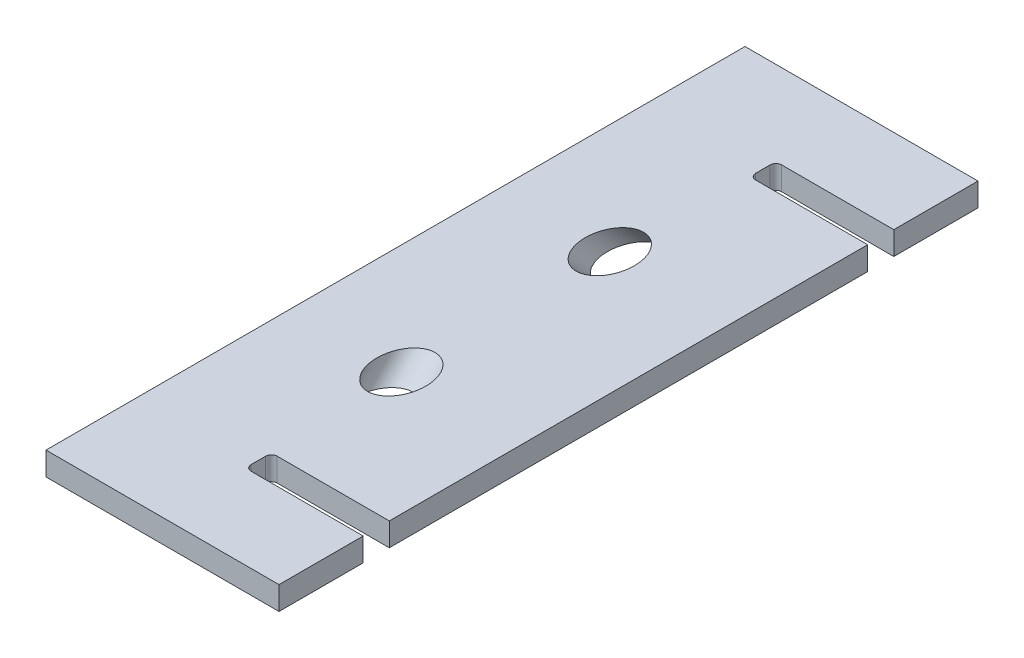
ISO-10303-21;
HEADER;
FILE_DESCRIPTION(('STEP AP214'),'2;1');
FILE_NAME('part.step','',(''),(''),'','','');
FILE_SCHEMA(('AUTOMOTIVE_DESIGN { 1 0 10303 214 1 1 1 1 }'));
ENDSEC;
DATA;
#1=APPLICATION_CONTEXT('core data for automotive mechanical design processes');
#2=APPLICATION_PROTOCOL_DEFINITION('international standard','automotive_design',2000,#1);
#3=PRODUCT_CONTEXT('',#1,'mechanical');
#4=PRODUCT('Part','Part','',(#3));
#5=PRODUCT_RELATED_PRODUCT_CATEGORY('part','',(#4));
#6=PRODUCT_DEFINITION_FORMATION('','',#4);
#7=PRODUCT_DEFINITION_CONTEXT('part definition',#1,'design');
#8=PRODUCT_DEFINITION('design','',#6,#7);
#9=PRODUCT_DEFINITION_SHAPE('','',#8);
#10=(LENGTH_UNIT() NAMED_UNIT(*) SI_UNIT(.MILLI.,.METRE.));
#11=(NAMED_UNIT(*) PLANE_ANGLE_UNIT() SI_UNIT($,.RADIAN.));
#12=(NAMED_UNIT(*) SI_UNIT($,.STERADIAN.) SOLID_ANGLE_UNIT());
#13=UNCERTAINTY_MEASURE_WITH_UNIT(LENGTH_MEASURE(1.E-05),#10,'distance_accuracy_value','');
#14=(GEOMETRIC_REPRESENTATION_CONTEXT(3) GLOBAL_UNCERTAINTY_ASSIGNED_CONTEXT((#13)) GLOBAL_UNIT_ASSIGNED_CONTEXT((#10,
#11,#12)) REPRESENTATION_CONTEXT('',''));
#15=CARTESIAN_POINT('',(0.,0.,0.));
#16=DIRECTION('',(0.,0.,1.));
#17=DIRECTION('',(1.,0.,0.));
#18=AXIS2_PLACEMENT_3D('',#15,#16,#17);
#19=CARTESIAN_POINT('',(2540.,217.4,-190.5));
#20=DIRECTION('',(-1.,0.,0.));
#21=DIRECTION('',(0.,0.,1.));
#22=AXIS2_PLACEMENT_3D('',#19,#20,#21);
#23=PLANE('',#22);
#24=DIRECTION('',(0.,0.,1.));
#25=VECTOR('',#24,1.);
#26=CARTESIAN_POINT('',(2540.,230.1,-190.5));
#27=LINE('',#26,#25);
#28=CARTESIAN_POINT('',(2540.,230.1,-190.5));
#29=VERTEX_POINT('',#28);
#30=CARTESIAN_POINT('',(2540.,230.1,190.5));
#31=VERTEX_POINT('',#30);
#32=EDGE_CURVE('E205',#29,#31,#27,.T.);
#33=ORIENTED_EDGE('',*,*,#32,.F.);
#34=DIRECTION('',(0.,1.,0.));
#35=VECTOR('',#34,1.);
#36=CARTESIAN_POINT('',(2540.,217.4,-190.5));
#37=LINE('',#36,#35);
#38=CARTESIAN_POINT('',(2540.,217.4,-190.5));
#39=VERTEX_POINT('',#38);
#40=EDGE_CURVE('E185',#39,#29,#37,.T.);
#41=ORIENTED_EDGE('',*,*,#40,.F.);
#42=DIRECTION('',(0.,0.,1.));
#43=VECTOR('',#42,1.);
#44=CARTESIAN_POINT('',(2540.,217.4,-190.5));
#45=LINE('',#44,#43);
#46=CARTESIAN_POINT('',(2540.,217.4,190.5));
#47=VERTEX_POINT('',#46);
#48=EDGE_CURVE('E170',#39,#47,#45,.T.);
#49=ORIENTED_EDGE('',*,*,#48,.T.);
#50=DIRECTION('',(0.,1.,0.));
#51=VECTOR('',#50,1.);
#52=CARTESIAN_POINT('',(2540.,217.4,190.5));
#53=LINE('',#52,#51);
#54=EDGE_CURVE('E158',#47,#31,#53,.T.);
#55=ORIENTED_EDGE('',*,*,#54,.T.);
#56=EDGE_LOOP('',(#33,#41,#49,#55));
#57=FACE_BOUND('',#56,.T.);
#58=ADVANCED_FACE('F46',(#57),#23,.T.);
#59=CARTESIAN_POINT('',(2540.,217.4,-190.5));
#60=DIRECTION('',(0.,0.,-1.));
#61=DIRECTION('',(-1.,0.,0.));
#62=AXIS2_PLACEMENT_3D('',#59,#60,#61);
#63=PLANE('',#62);
#64=DIRECTION('',(-1.,0.,0.));
#65=VECTOR('',#64,1.);
#66=CARTESIAN_POINT('',(2540.,230.1,-190.5));
#67=LINE('',#66,#65);
#68=CARTESIAN_POINT('',(2667.,230.1,-190.5));
#69=VERTEX_POINT('',#68);
#70=EDGE_CURVE('E226',#69,#29,#67,.T.);
#71=ORIENTED_EDGE('',*,*,#70,.F.);
#72=DIRECTION('',(0.,1.,0.));
#73=VECTOR('',#72,1.);
#74=CARTESIAN_POINT('',(2667.,217.4,-190.5));
#75=LINE('',#74,#73);
#76=CARTESIAN_POINT('',(2667.,217.4,-190.5));
#77=VERTEX_POINT('',#76);
#78=EDGE_CURVE('E202',#77,#69,#75,.T.);
#79=ORIENTED_EDGE('',*,*,#78,.F.);
#80=DIRECTION('',(-1.,0.,0.));
#81=VECTOR('',#80,1.);
#82=CARTESIAN_POINT('',(2540.,217.4,-190.5));
#83=LINE('',#82,#81);
#84=EDGE_CURVE('E169',#77,#39,#83,.T.);
#85=ORIENTED_EDGE('',*,*,#84,.T.);
#86=ORIENTED_EDGE('',*,*,#40,.T.);
#87=EDGE_LOOP('',(#71,#79,#85,#86));
#88=FACE_BOUND('',#87,.T.);
#89=ADVANCED_FACE('F397',(#88),#63,.T.);
#90=CARTESIAN_POINT('',(2667.,217.4,-190.5));
#91=DIRECTION('',(1.,0.,0.));
#92=DIRECTION('',(0.,0.,-1.));
#93=AXIS2_PLACEMENT_3D('',#90,#91,#92);
#94=PLANE('',#93);
#95=DIRECTION('',(0.,0.,-1.));
#96=VECTOR('',#95,1.);
#97=CARTESIAN_POINT('',(2667.,230.1,-190.5));
#98=LINE('',#97,#96);
#99=CARTESIAN_POINT('',(2667.,230.1,-144.604086105115));
#100=VERTEX_POINT('',#99);
#101=EDGE_CURVE('E222',#100,#69,#98,.T.);
#102=ORIENTED_EDGE('',*,*,#101,.F.);
#103=DIRECTION('',(0.,1.,0.));
#104=VECTOR('',#103,1.);
#105=CARTESIAN_POINT('',(2667.,217.4,-144.604086105115));
#106=LINE('',#105,#104);
#107=CARTESIAN_POINT('',(2667.,217.4,-144.604086105115));
#108=VERTEX_POINT('',#107);
#109=EDGE_CURVE('E263',#108,#100,#106,.T.);
#110=ORIENTED_EDGE('',*,*,#109,.F.);
#111=DIRECTION('',(0.,0.,-1.));
#112=VECTOR('',#111,1.);
#113=CARTESIAN_POINT('',(2667.,217.4,-190.5));
#114=LINE('',#113,#112);
#115=EDGE_CURVE('E198',#108,#77,#114,.T.);
#116=ORIENTED_EDGE('',*,*,#115,.T.);
#117=ORIENTED_EDGE('',*,*,#78,.T.);
#118=EDGE_LOOP('',(#102,#110,#116,#117));
#119=FACE_BOUND('',#118,.T.);
#120=ADVANCED_FACE('F394',(#119),#94,.T.);
#121=CARTESIAN_POINT('',(2603.5,217.4,-144.604086105115));
#122=DIRECTION('',(0.,0.,1.));
#123=DIRECTION('',(1.,0.,0.));
#124=AXIS2_PLACEMENT_3D('',#121,#122,#123);
#125=PLANE('',#124);
#126=DIRECTION('',(1.,0.,0.));
#127=VECTOR('',#126,1.);
#128=CARTESIAN_POINT('',(0.,230.1,-144.604086105115));
#129=LINE('',#128,#127);
#130=CARTESIAN_POINT('',(2605.913,230.1,-144.604086105115));
#131=VERTEX_POINT('',#130);
#132=EDGE_CURVE('E227',#131,#100,#129,.T.);
#133=ORIENTED_EDGE('',*,*,#132,.F.);
#134=DIRECTION('',(0.,1.,0.));
#135=VECTOR('',#134,1.);
#136=CARTESIAN_POINT('',(2605.913,217.4,-144.604086105115));
#137=LINE('',#136,#135);
#138=CARTESIAN_POINT('',(2605.913,217.4,-144.604086105115));
#139=VERTEX_POINT('',#138);
#140=EDGE_CURVE('E308',#131,#139,#137,.F.);
#141=ORIENTED_EDGE('',*,*,#140,.T.);
#142=DIRECTION('',(1.,0.,0.));
#143=VECTOR('',#142,1.);
#144=CARTESIAN_POINT('',(0.,217.4,-144.604086105115));
#145=LINE('',#144,#143);
#146=EDGE_CURVE('E236',#139,#108,#145,.T.);
#147=ORIENTED_EDGE('',*,*,#146,.T.);
#148=ORIENTED_EDGE('',*,*,#109,.T.);
#149=EDGE_LOOP('',(#133,#141,#147,#148));
#150=FACE_BOUND('',#149,.T.);
#151=ADVANCED_FACE('F390',(#150),#125,.T.);
#152=CARTESIAN_POINT('',(2602.738,217.4,-131.142086105115));
#153=DIRECTION('',(1.,0.,0.));
#154=DIRECTION('',(0.,0.,-1.));
#155=AXIS2_PLACEMENT_3D('',#152,#153,#154);
#156=PLANE('',#155);
#157=DIRECTION('',(0.,0.,-1.));
#158=VECTOR('',#157,1.);
#159=CARTESIAN_POINT('',(2602.738,217.4,9.10116426666717E-11));
#160=LINE('',#159,#158);
#161=CARTESIAN_POINT('',(2602.738,217.4,-133.555086105115));
#162=VERTEX_POINT('',#161);
#163=CARTESIAN_POINT('',(2602.738,217.4,-141.429086105115));
#164=VERTEX_POINT('',#163);
#165=EDGE_CURVE('E267',#162,#164,#160,.T.);
#166=ORIENTED_EDGE('',*,*,#165,.T.);
#167=DIRECTION('',(0.,1.,0.));
#168=VECTOR('',#167,1.);
#169=CARTESIAN_POINT('',(2602.738,230.1,-141.429086105115));
#170=LINE('',#169,#168);
#171=CARTESIAN_POINT('',(2602.738,230.1,-141.429086105115));
#172=VERTEX_POINT('',#171);
#173=EDGE_CURVE('E304',#164,#172,#170,.T.);
#174=ORIENTED_EDGE('',*,*,#173,.T.);
#175=DIRECTION('',(0.,0.,-1.));
#176=VECTOR('',#175,1.);
#177=CARTESIAN_POINT('',(2602.738,230.1,9.10116426666717E-11));
#178=LINE('',#177,#176);
#179=CARTESIAN_POINT('',(2602.738,230.1,-133.555086105115));
#180=VERTEX_POINT('',#179);
#181=EDGE_CURVE('E257',#180,#172,#178,.T.);
#182=ORIENTED_EDGE('',*,*,#181,.F.);
#183=DIRECTION('',(0.,1.,0.));
#184=VECTOR('',#183,1.);
#185=CARTESIAN_POINT('',(2602.738,217.4,-133.555086105115));
#186=LINE('',#185,#184);
#187=EDGE_CURVE('E247',#180,#162,#186,.F.);
#188=ORIENTED_EDGE('',*,*,#187,.T.);
#189=EDGE_LOOP('',(#166,#174,#182,#188));
#190=FACE_BOUND('',#189,.T.);
#191=ADVANCED_FACE('F380',(#190),#156,.T.);
#192=CARTESIAN_POINT('',(2667.,217.4,-130.380086105115));
#193=DIRECTION('',(0.,0.,-1.));
#194=DIRECTION('',(-1.,0.,0.));
#195=AXIS2_PLACEMENT_3D('',#192,#193,#194);
#196=PLANE('',#195);
#197=DIRECTION('',(-1.,0.,0.));
#198=VECTOR('',#197,1.);
#199=CARTESIAN_POINT('',(0.,217.4,-130.380086105115));
#200=LINE('',#199,#198);
#201=CARTESIAN_POINT('',(2667.,217.4,-130.380086105115));
#202=VERTEX_POINT('',#201);
#203=CARTESIAN_POINT('',(2605.913,217.4,-130.380086105115));
#204=VERTEX_POINT('',#203);
#205=EDGE_CURVE('E197',#202,#204,#200,.T.);
#206=ORIENTED_EDGE('',*,*,#205,.T.);
#207=DIRECTION('',(0.,1.,0.));
#208=VECTOR('',#207,1.);
#209=CARTESIAN_POINT('',(2605.913,230.1,-130.380086105115));
#210=LINE('',#209,#208);
#211=CARTESIAN_POINT('',(2605.913,230.1,-130.380086105115));
#212=VERTEX_POINT('',#211);
#213=EDGE_CURVE('E311',#204,#212,#210,.T.);
#214=ORIENTED_EDGE('',*,*,#213,.T.);
#215=DIRECTION('',(-1.,0.,0.));
#216=VECTOR('',#215,1.);
#217=CARTESIAN_POINT('',(0.,230.1,-130.380086105115));
#218=LINE('',#217,#216);
#219=CARTESIAN_POINT('',(2667.,230.1,-130.380086105115));
#220=VERTEX_POINT('',#219);
#221=EDGE_CURVE('E220',#220,#212,#218,.T.);
#222=ORIENTED_EDGE('',*,*,#221,.F.);
#223=DIRECTION('',(0.,1.,0.));
#224=VECTOR('',#223,1.);
#225=CARTESIAN_POINT('',(2667.,217.4,-130.380086105115));
#226=LINE('',#225,#224);
#227=EDGE_CURVE('E196',#202,#220,#226,.T.);
#228=ORIENTED_EDGE('',*,*,#227,.F.);
#229=EDGE_LOOP('',(#206,#214,#222,#228));
#230=FACE_BOUND('',#229,.T.);
#231=ADVANCED_FACE('F372',(#230),#196,.T.);
#232=CARTESIAN_POINT('',(2667.,217.4,-131.142086105115));
#233=DIRECTION('',(1.,0.,0.));
#234=DIRECTION('',(0.,0.,-1.));
#235=AXIS2_PLACEMENT_3D('',#232,#233,#234);
#236=PLANE('',#235);
#237=DIRECTION('',(0.,0.,-1.));
#238=VECTOR('',#237,1.);
#239=CARTESIAN_POINT('',(2667.,230.1,-131.142086105115));
#240=LINE('',#239,#238);
#241=CARTESIAN_POINT('',(2667.,230.1,130.380086105115));
#242=VERTEX_POINT('',#241);
#243=EDGE_CURVE('E216',#242,#220,#240,.T.);
#244=ORIENTED_EDGE('',*,*,#243,.F.);
#245=DIRECTION('',(0.,1.,0.));
#246=VECTOR('',#245,1.);
#247=CARTESIAN_POINT('',(2667.,217.4,130.380086105115));
#248=LINE('',#247,#246);
#249=CARTESIAN_POINT('',(2667.,217.4,130.380086105115));
#250=VERTEX_POINT('',#249);
#251=EDGE_CURVE('E282',#250,#242,#248,.T.);
#252=ORIENTED_EDGE('',*,*,#251,.F.);
#253=DIRECTION('',(0.,0.,-1.));
#254=VECTOR('',#253,1.);
#255=CARTESIAN_POINT('',(2667.,217.4,-131.142086105115));
#256=LINE('',#255,#254);
#257=EDGE_CURVE('E192',#250,#202,#256,.T.);
#258=ORIENTED_EDGE('',*,*,#257,.T.);
#259=ORIENTED_EDGE('',*,*,#227,.T.);
#260=EDGE_LOOP('',(#244,#252,#258,#259));
#261=FACE_BOUND('',#260,.T.);
#262=ADVANCED_FACE('F368',(#261),#236,.T.);
#263=CARTESIAN_POINT('',(2603.5,217.4,130.380086105115));
#264=DIRECTION('',(0.,0.,1.));
#265=DIRECTION('',(1.,0.,0.));
#266=AXIS2_PLACEMENT_3D('',#263,#264,#265);
#267=PLANE('',#266);
#268=DIRECTION('',(1.,0.,0.));
#269=VECTOR('',#268,1.);
#270=CARTESIAN_POINT('',(0.,230.1,130.380086105115));
#271=LINE('',#270,#269);
#272=CARTESIAN_POINT('',(2605.913,230.1,130.380086105115));
#273=VERTEX_POINT('',#272);
#274=EDGE_CURVE('E221',#273,#242,#271,.T.);
#275=ORIENTED_EDGE('',*,*,#274,.F.);
#276=DIRECTION('',(0.,1.,0.));
#277=VECTOR('',#276,1.);
#278=CARTESIAN_POINT('',(2605.913,217.4,130.380086105115));
#279=LINE('',#278,#277);
#280=CARTESIAN_POINT('',(2605.913,217.4,130.380086105115));
#281=VERTEX_POINT('',#280);
#282=EDGE_CURVE('E62',#273,#281,#279,.F.);
#283=ORIENTED_EDGE('',*,*,#282,.T.);
#284=DIRECTION('',(1.,0.,0.));
#285=VECTOR('',#284,1.);
#286=CARTESIAN_POINT('',(0.,217.4,130.380086105115));
#287=LINE('',#286,#285);
#288=EDGE_CURVE('E278',#281,#250,#287,.T.);
#289=ORIENTED_EDGE('',*,*,#288,.T.);
#290=ORIENTED_EDGE('',*,*,#251,.T.);
#291=EDGE_LOOP('',(#275,#283,#289,#290));
#292=FACE_BOUND('',#291,.T.);
#293=ADVANCED_FACE('F365',(#292),#267,.T.);
#294=CARTESIAN_POINT('',(2602.738,217.4,143.842086105115));
#295=DIRECTION('',(1.,0.,0.));
#296=DIRECTION('',(0.,0.,-1.));
#297=AXIS2_PLACEMENT_3D('',#294,#295,#296);
#298=PLANE('',#297);
#299=DIRECTION('',(0.,0.,-1.));
#300=VECTOR('',#299,1.);
#301=CARTESIAN_POINT('',(2602.738,230.1,0.));
#302=LINE('',#301,#300);
#303=CARTESIAN_POINT('',(2602.738,230.1,141.429086105115));
#304=VERTEX_POINT('',#303);
#305=CARTESIAN_POINT('',(2602.738,230.1,133.555086105115));
#306=VERTEX_POINT('',#305);
#307=EDGE_CURVE('E281',#304,#306,#302,.T.);
#308=ORIENTED_EDGE('',*,*,#307,.F.);
#309=DIRECTION('',(0.,1.,0.));
#310=VECTOR('',#309,1.);
#311=CARTESIAN_POINT('',(2602.738,217.4,141.429086105115));
#312=LINE('',#311,#310);
#313=CARTESIAN_POINT('',(2602.738,217.4,141.429086105115));
#314=VERTEX_POINT('',#313);
#315=EDGE_CURVE('E323',#304,#314,#312,.F.);
#316=ORIENTED_EDGE('',*,*,#315,.T.);
#317=DIRECTION('',(0.,0.,-1.));
#318=VECTOR('',#317,1.);
#319=CARTESIAN_POINT('',(2602.738,217.4,0.));
#320=LINE('',#319,#318);
#321=CARTESIAN_POINT('',(2602.738,217.4,133.555086105115));
#322=VERTEX_POINT('',#321);
#323=EDGE_CURVE('E286',#314,#322,#320,.T.);
#324=ORIENTED_EDGE('',*,*,#323,.T.);
#325=DIRECTION('',(0.,1.,0.));
#326=VECTOR('',#325,1.);
#327=CARTESIAN_POINT('',(2602.738,230.1,133.555086105115));
#328=LINE('',#327,#326);
#329=EDGE_CURVE('E319',#322,#306,#328,.T.);
#330=ORIENTED_EDGE('',*,*,#329,.T.);
#331=EDGE_LOOP('',(#308,#316,#324,#330));
#332=FACE_BOUND('',#331,.T.);
#333=ADVANCED_FACE('F358',(#332),#298,.T.);
#334=CARTESIAN_POINT('',(2667.,217.4,144.604086105115));
#335=DIRECTION('',(0.,0.,-1.));
#336=DIRECTION('',(-1.,0.,0.));
#337=AXIS2_PLACEMENT_3D('',#334,#335,#336);
#338=PLANE('',#337);
#339=DIRECTION('',(-1.,0.,0.));
#340=VECTOR('',#339,1.);
#341=CARTESIAN_POINT('',(0.,217.4,144.604086105115));
#342=LINE('',#341,#340);
#343=CARTESIAN_POINT('',(2667.,217.4,144.604086105115));
#344=VERTEX_POINT('',#343);
#345=CARTESIAN_POINT('',(2605.913,217.4,144.604086105115));
#346=VERTEX_POINT('',#345);
#347=EDGE_CURVE('E191',#344,#346,#342,.T.);
#348=ORIENTED_EDGE('',*,*,#347,.T.);
#349=DIRECTION('',(0.,1.,0.));
#350=VECTOR('',#349,1.);
#351=CARTESIAN_POINT('',(2605.913,230.1,144.604086105115));
#352=LINE('',#351,#350);
#353=CARTESIAN_POINT('',(2605.913,230.1,144.604086105115));
#354=VERTEX_POINT('',#353);
#355=EDGE_CURVE('E315',#346,#354,#352,.T.);
#356=ORIENTED_EDGE('',*,*,#355,.T.);
#357=DIRECTION('',(-1.,0.,0.));
#358=VECTOR('',#357,1.);
#359=CARTESIAN_POINT('',(0.,230.1,144.604086105115));
#360=LINE('',#359,#358);
#361=CARTESIAN_POINT('',(2667.,230.1,144.604086105115));
#362=VERTEX_POINT('',#361);
#363=EDGE_CURVE('E215',#362,#354,#360,.T.);
#364=ORIENTED_EDGE('',*,*,#363,.F.);
#365=DIRECTION('',(0.,1.,0.));
#366=VECTOR('',#365,1.);
#367=CARTESIAN_POINT('',(2667.,217.4,144.604086105115));
#368=LINE('',#367,#366);
#369=EDGE_CURVE('E183',#344,#362,#368,.T.);
#370=ORIENTED_EDGE('',*,*,#369,.F.);
#371=EDGE_LOOP('',(#348,#356,#364,#370));
#372=FACE_BOUND('',#371,.T.);
#373=ADVANCED_FACE('F352',(#372),#338,.T.);
#374=CARTESIAN_POINT('',(2667.,217.4,143.842086105115));
#375=DIRECTION('',(1.,0.,0.));
#376=DIRECTION('',(0.,0.,-1.));
#377=AXIS2_PLACEMENT_3D('',#374,#375,#376);
#378=PLANE('',#377);
#379=DIRECTION('',(0.,0.,-1.));
#380=VECTOR('',#379,1.);
#381=CARTESIAN_POINT('',(2667.,230.1,143.842086105115));
#382=LINE('',#381,#380);
#383=CARTESIAN_POINT('',(2667.,230.1,190.5));
#384=VERTEX_POINT('',#383);
#385=EDGE_CURVE('E211',#384,#362,#382,.T.);
#386=ORIENTED_EDGE('',*,*,#385,.F.);
#387=DIRECTION('',(0.,1.,0.));
#388=VECTOR('',#387,1.);
#389=CARTESIAN_POINT('',(2667.,217.4,190.5));
#390=LINE('',#389,#388);
#391=CARTESIAN_POINT('',(2667.,217.4,190.5));
#392=VERTEX_POINT('',#391);
#393=EDGE_CURVE('E182',#392,#384,#390,.T.);
#394=ORIENTED_EDGE('',*,*,#393,.F.);
#395=DIRECTION('',(0.,0.,-1.));
#396=VECTOR('',#395,1.);
#397=CARTESIAN_POINT('',(2667.,217.4,143.842086105115));
#398=LINE('',#397,#396);
#399=EDGE_CURVE('E180',#392,#344,#398,.T.);
#400=ORIENTED_EDGE('',*,*,#399,.T.);
#401=ORIENTED_EDGE('',*,*,#369,.T.);
#402=EDGE_LOOP('',(#386,#394,#400,#401));
#403=FACE_BOUND('',#402,.T.);
#404=ADVANCED_FACE('F400',(#403),#378,.T.);
#405=CARTESIAN_POINT('',(2540.,217.4,190.5));
#406=DIRECTION('',(0.,0.,1.));
#407=DIRECTION('',(1.,0.,0.));
#408=AXIS2_PLACEMENT_3D('',#405,#406,#407);
#409=PLANE('',#408);
#410=DIRECTION('',(1.,0.,0.));
#411=VECTOR('',#410,1.);
#412=CARTESIAN_POINT('',(2540.,230.1,190.5));
#413=LINE('',#412,#411);
#414=EDGE_CURVE('E163',#31,#384,#413,.T.);
#415=ORIENTED_EDGE('',*,*,#414,.F.);
#416=ORIENTED_EDGE('',*,*,#54,.F.);
#417=DIRECTION('',(1.,0.,0.));
#418=VECTOR('',#417,1.);
#419=CARTESIAN_POINT('',(2540.,217.4,190.5));
#420=LINE('',#419,#418);
#421=EDGE_CURVE('E161',#47,#392,#420,.T.);
#422=ORIENTED_EDGE('',*,*,#421,.T.);
#423=ORIENTED_EDGE('',*,*,#393,.T.);
#424=EDGE_LOOP('',(#415,#416,#422,#423));
#425=FACE_BOUND('',#424,.T.);
#426=ADVANCED_FACE('F160',(#425),#409,.T.);
#427=CARTESIAN_POINT('',(0.,217.4,0.));
#428=DIRECTION('',(0.,1.,0.));
#429=DIRECTION('',(0.,0.,1.));
#430=AXIS2_PLACEMENT_3D('',#427,#428,#429);
#431=PLANE('',#430);
#432=CARTESIAN_POINT('',(2599.99999999996,217.4,-68.8448275862046));
#433=DIRECTION('',(0.,1.,0.));
#434=DIRECTION('',(0.,0.,1.));
#435=AXIS2_PLACEMENT_3D('',#432,#433,#434);
#436=ELLIPSE('',#435,18.37729007727,13.3349999999999);
#437=CARTESIAN_POINT('',(2599.99999999996,217.4,-50.4675375089346));
#438=VERTEX_POINT('',#437);
#439=EDGE_CURVE('E243',#438,#438,#436,.F.);
#440=ORIENTED_EDGE('',*,*,#439,.F.);
#441=EDGE_LOOP('',(#440));
#442=FACE_BOUND('',#441,.T.);
#443=CARTESIAN_POINT('',(2599.99999999996,217.4,68.8448275862026));
#444=DIRECTION('',(0.,1.,0.));
#445=DIRECTION('',(0.,0.,1.));
#446=AXIS2_PLACEMENT_3D('',#443,#444,#445);
#447=ELLIPSE('',#446,18.3772900772699,13.3349999999999);
#448=CARTESIAN_POINT('',(2599.99999999996,217.4,87.2221176634725));
#449=VERTEX_POINT('',#448);
#450=EDGE_CURVE('E231',#449,#449,#447,.F.);
#451=ORIENTED_EDGE('',*,*,#450,.F.);
#452=EDGE_LOOP('',(#451));
#453=FACE_BOUND('',#452,.T.);
#454=ORIENTED_EDGE('',*,*,#48,.F.);
#455=ORIENTED_EDGE('',*,*,#84,.F.);
#456=ORIENTED_EDGE('',*,*,#115,.F.);
#457=ORIENTED_EDGE('',*,*,#146,.F.);
#458=CARTESIAN_POINT('',(2605.913,217.4,-141.429086105115));
#459=DIRECTION('',(0.,1.,0.));
#460=DIRECTION('',(0.,0.,1.));
#461=AXIS2_PLACEMENT_3D('',#458,#459,#460);
#462=CIRCLE('',#461,3.175);
#463=EDGE_CURVE('E331',#139,#164,#462,.T.);
#464=ORIENTED_EDGE('',*,*,#463,.T.);
#465=ORIENTED_EDGE('',*,*,#165,.F.);
#466=CARTESIAN_POINT('',(2605.913,217.4,-133.555086105115));
#467=DIRECTION('',(0.,1.,0.));
#468=DIRECTION('',(0.,0.,1.));
#469=AXIS2_PLACEMENT_3D('',#466,#467,#468);
#470=CIRCLE('',#469,3.175);
#471=EDGE_CURVE('E337',#162,#204,#470,.T.);
#472=ORIENTED_EDGE('',*,*,#471,.T.);
#473=ORIENTED_EDGE('',*,*,#205,.F.);
#474=ORIENTED_EDGE('',*,*,#257,.F.);
#475=ORIENTED_EDGE('',*,*,#288,.F.);
#476=CARTESIAN_POINT('',(2605.913,217.4,133.555086105115));
#477=DIRECTION('',(0.,1.,0.));
#478=DIRECTION('',(0.,0.,1.));
#479=AXIS2_PLACEMENT_3D('',#476,#477,#478);
#480=CIRCLE('',#479,3.175);
#481=EDGE_CURVE('E12',#281,#322,#480,.T.);
#482=ORIENTED_EDGE('',*,*,#481,.T.);
#483=ORIENTED_EDGE('',*,*,#323,.F.);
#484=CARTESIAN_POINT('',(2605.913,217.4,141.429086105115));
#485=DIRECTION('',(0.,1.,0.));
#486=DIRECTION('',(0.,0.,1.));
#487=AXIS2_PLACEMENT_3D('',#484,#485,#486);
#488=CIRCLE('',#487,3.175);
#489=EDGE_CURVE('E343',#314,#346,#488,.T.);
#490=ORIENTED_EDGE('',*,*,#489,.T.);
#491=ORIENTED_EDGE('',*,*,#347,.F.);
#492=ORIENTED_EDGE('',*,*,#399,.F.);
#493=ORIENTED_EDGE('',*,*,#421,.F.);
#494=EDGE_LOOP('',(#454,#455,#456,#457,#464,#465,#472,#473,#474,#475,#482,#483,#490,#491,#492,#493));
#495=FACE_BOUND('',#494,.T.);
#496=ADVANCED_FACE('F175',(#442,#453,#495),#431,.F.);
#497=CARTESIAN_POINT('',(0.,230.1,0.));
#498=DIRECTION('',(0.,1.,0.));
#499=DIRECTION('',(0.,0.,1.));
#500=AXIS2_PLACEMENT_3D('',#497,#498,#499);
#501=PLANE('',#500);
#502=CARTESIAN_POINT('',(2599.99999999996,230.1,-56.8017241379285));
#503=DIRECTION('',(0.,1.,0.));
#504=DIRECTION('',(0.,0.,1.));
#505=AXIS2_PLACEMENT_3D('',#502,#503,#504);
#506=ELLIPSE('',#505,18.37729007727,13.3349999999999);
#507=CARTESIAN_POINT('',(2599.99999999996,230.1,-38.4244340606586));
#508=VERTEX_POINT('',#507);
#509=EDGE_CURVE('E238',#508,#508,#506,.F.);
#510=ORIENTED_EDGE('',*,*,#509,.T.);
#511=EDGE_LOOP('',(#510));
#512=FACE_BOUND('',#511,.T.);
#513=CARTESIAN_POINT('',(2599.99999999996,230.1,56.8017241379268));
#514=DIRECTION('',(0.,1.,0.));
#515=DIRECTION('',(0.,0.,1.));
#516=AXIS2_PLACEMENT_3D('',#513,#514,#515);
#517=ELLIPSE('',#516,18.3772900772699,13.3349999999999);
#518=CARTESIAN_POINT('',(2599.99999999996,230.1,75.1790142151966));
#519=VERTEX_POINT('',#518);
#520=EDGE_CURVE('E208',#519,#519,#517,.F.);
#521=ORIENTED_EDGE('',*,*,#520,.T.);
#522=EDGE_LOOP('',(#521));
#523=FACE_BOUND('',#522,.T.);
#524=ORIENTED_EDGE('',*,*,#32,.T.);
#525=ORIENTED_EDGE('',*,*,#414,.T.);
#526=ORIENTED_EDGE('',*,*,#385,.T.);
#527=ORIENTED_EDGE('',*,*,#363,.T.);
#528=CARTESIAN_POINT('',(2605.913,230.1,141.429086105115));
#529=DIRECTION('',(0.,1.,0.));
#530=DIRECTION('',(0.,0.,1.));
#531=AXIS2_PLACEMENT_3D('',#528,#529,#530);
#532=CIRCLE('',#531,3.175);
#533=EDGE_CURVE('E340',#354,#304,#532,.F.);
#534=ORIENTED_EDGE('',*,*,#533,.T.);
#535=ORIENTED_EDGE('',*,*,#307,.T.);
#536=CARTESIAN_POINT('',(2605.913,230.1,133.555086105115));
#537=DIRECTION('',(0.,1.,0.));
#538=DIRECTION('',(0.,0.,1.));
#539=AXIS2_PLACEMENT_3D('',#536,#537,#538);
#540=CIRCLE('',#539,3.175);
#541=EDGE_CURVE('E55',#306,#273,#540,.F.);
#542=ORIENTED_EDGE('',*,*,#541,.T.);
#543=ORIENTED_EDGE('',*,*,#274,.T.);
#544=ORIENTED_EDGE('',*,*,#243,.T.);
#545=ORIENTED_EDGE('',*,*,#221,.T.);
#546=CARTESIAN_POINT('',(2605.913,230.1,-133.555086105115));
#547=DIRECTION('',(0.,1.,0.));
#548=DIRECTION('',(0.,0.,1.));
#549=AXIS2_PLACEMENT_3D('',#546,#547,#548);
#550=CIRCLE('',#549,3.175);
#551=EDGE_CURVE('E334',#212,#180,#550,.F.);
#552=ORIENTED_EDGE('',*,*,#551,.T.);
#553=ORIENTED_EDGE('',*,*,#181,.T.);
#554=CARTESIAN_POINT('',(2605.913,230.1,-141.429086105115));
#555=DIRECTION('',(0.,1.,0.));
#556=DIRECTION('',(0.,0.,1.));
#557=AXIS2_PLACEMENT_3D('',#554,#555,#556);
#558=CIRCLE('',#557,3.175);
#559=EDGE_CURVE('E328',#172,#131,#558,.F.);
#560=ORIENTED_EDGE('',*,*,#559,.T.);
#561=ORIENTED_EDGE('',*,*,#132,.T.);
#562=ORIENTED_EDGE('',*,*,#101,.T.);
#563=ORIENTED_EDGE('',*,*,#70,.T.);
#564=EDGE_LOOP('',(#524,#525,#526,#527,#534,#535,#542,#543,#544,#545,#552,#553,#560,#561,#562,#563));
#565=FACE_BOUND('',#564,.T.);
#566=ADVANCED_FACE('F356',(#512,#523,#565),#501,.T.);
#567=CARTESIAN_POINT('',(2599.99999999996,289.999999999996,-4.44089209850063E-13));
#568=DIRECTION('',(0.,-0.725623851173434,0.688091583009292));
#569=DIRECTION('',(0.,-0.688091583009292,-0.725623851173434));
#570=AXIS2_PLACEMENT_3D('',#567,#568,#569);
#571=CYLINDRICAL_SURFACE('',#570,13.3349999999999);
#572=ORIENTED_EDGE('',*,*,#520,.F.);
#573=EDGE_LOOP('',(#572));
#574=FACE_BOUND('',#573,.T.);
#575=ORIENTED_EDGE('',*,*,#450,.T.);
#576=EDGE_LOOP('',(#575));
#577=FACE_BOUND('',#576,.T.);
#578=ADVANCED_FACE('F419',(#574,#577),#571,.F.);
#579=CARTESIAN_POINT('',(2599.99999999996,0.,-275.000000000001));
#580=DIRECTION('',(0.,0.725623851173429,0.688091583009297));
#581=DIRECTION('',(0.,-0.688091583009297,0.725623851173429));
#582=AXIS2_PLACEMENT_3D('',#579,#580,#581);
#583=CYLINDRICAL_SURFACE('',#582,13.3349999999999);
#584=ORIENTED_EDGE('',*,*,#509,.F.);
#585=EDGE_LOOP('',(#584));
#586=FACE_BOUND('',#585,.T.);
#587=ORIENTED_EDGE('',*,*,#439,.T.);
#588=EDGE_LOOP('',(#587));
#589=FACE_BOUND('',#588,.T.);
#590=ADVANCED_FACE('F424',(#586,#589),#583,.F.);
#591=CARTESIAN_POINT('',(2605.913,217.4,-141.429086105115));
#592=DIRECTION('',(0.,-1.,0.));
#593=DIRECTION('',(0.,0.,-1.));
#594=AXIS2_PLACEMENT_3D('',#591,#592,#593);
#595=CYLINDRICAL_SURFACE('',#594,3.175);
#596=ORIENTED_EDGE('',*,*,#463,.F.);
#597=ORIENTED_EDGE('',*,*,#140,.F.);
#598=ORIENTED_EDGE('',*,*,#559,.F.);
#599=ORIENTED_EDGE('',*,*,#173,.F.);
#600=EDGE_LOOP('',(#596,#597,#598,#599));
#601=FACE_BOUND('',#600,.T.);
#602=ADVANCED_FACE('F387',(#601),#595,.F.);
#603=CARTESIAN_POINT('',(2605.913,217.4,-133.555086105115));
#604=DIRECTION('',(0.,-1.,0.));
#605=DIRECTION('',(0.,0.,-1.));
#606=AXIS2_PLACEMENT_3D('',#603,#604,#605);
#607=CYLINDRICAL_SURFACE('',#606,3.175);
#608=ORIENTED_EDGE('',*,*,#471,.F.);
#609=ORIENTED_EDGE('',*,*,#187,.F.);
#610=ORIENTED_EDGE('',*,*,#551,.F.);
#611=ORIENTED_EDGE('',*,*,#213,.F.);
#612=EDGE_LOOP('',(#608,#609,#610,#611));
#613=FACE_BOUND('',#612,.T.);
#614=ADVANCED_FACE('F376',(#613),#607,.F.);
#615=CARTESIAN_POINT('',(2605.913,217.4,141.429086105115));
#616=DIRECTION('',(0.,-1.,0.));
#617=DIRECTION('',(0.,0.,-1.));
#618=AXIS2_PLACEMENT_3D('',#615,#616,#617);
#619=CYLINDRICAL_SURFACE('',#618,3.175);
#620=ORIENTED_EDGE('',*,*,#489,.F.);
#621=ORIENTED_EDGE('',*,*,#315,.F.);
#622=ORIENTED_EDGE('',*,*,#533,.F.);
#623=ORIENTED_EDGE('',*,*,#355,.F.);
#624=EDGE_LOOP('',(#620,#621,#622,#623));
#625=FACE_BOUND('',#624,.T.);
#626=ADVANCED_FACE('F354',(#625),#619,.F.);
#627=CARTESIAN_POINT('',(2605.913,217.4,133.555086105115));
#628=DIRECTION('',(0.,-1.,0.));
#629=DIRECTION('',(0.,0.,-1.));
#630=AXIS2_PLACEMENT_3D('',#627,#628,#629);
#631=CYLINDRICAL_SURFACE('',#630,3.175);
#632=ORIENTED_EDGE('',*,*,#481,.F.);
#633=ORIENTED_EDGE('',*,*,#282,.F.);
#634=ORIENTED_EDGE('',*,*,#541,.F.);
#635=ORIENTED_EDGE('',*,*,#329,.F.);
#636=EDGE_LOOP('',(#632,#633,#634,#635));
#637=FACE_BOUND('',#636,.T.);
#638=ADVANCED_FACE('F48',(#637),#631,.F.);
#639=CLOSED_SHELL('',(#58,#89,#120,#151,#191,#231,#262,#293,#333,#373,#404,#426,#496,#566,#578,
#590,#602,#614,#626,#638));
#640=MANIFOLD_SOLID_BREP('B2',#639);
#641=ADVANCED_BREP_SHAPE_REPRESENTATION('',(#18,#640),#14);
#642=SHAPE_DEFINITION_REPRESENTATION(#9,#641);
ENDSEC;
END-ISO-10303-21;
